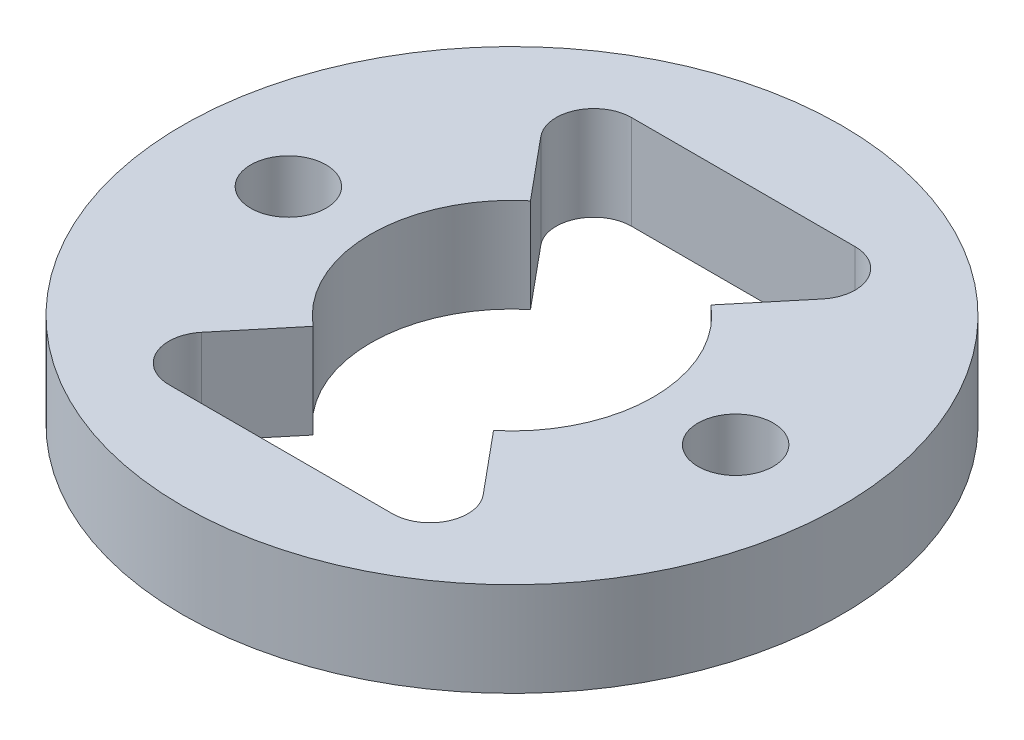
ISO-10303-21;
HEADER;
FILE_DESCRIPTION(('STEP AP214'),'2;1');
FILE_NAME('part.step','',(''),(''),'','','');
FILE_SCHEMA(('AUTOMOTIVE_DESIGN { 1 0 10303 214 1 1 1 1 }'));
ENDSEC;
DATA;
#1=APPLICATION_CONTEXT('core data for automotive mechanical design processes');
#2=APPLICATION_PROTOCOL_DEFINITION('international standard','automotive_design',2000,#1);
#3=PRODUCT_CONTEXT('',#1,'mechanical');
#4=PRODUCT('Part','Part','',(#3));
#5=PRODUCT_RELATED_PRODUCT_CATEGORY('part','',(#4));
#6=PRODUCT_DEFINITION_FORMATION('','',#4);
#7=PRODUCT_DEFINITION_CONTEXT('part definition',#1,'design');
#8=PRODUCT_DEFINITION('design','',#6,#7);
#9=PRODUCT_DEFINITION_SHAPE('','',#8);
#10=(LENGTH_UNIT() NAMED_UNIT(*) SI_UNIT(.MILLI.,.METRE.));
#11=(NAMED_UNIT(*) PLANE_ANGLE_UNIT() SI_UNIT($,.RADIAN.));
#12=(NAMED_UNIT(*) SI_UNIT($,.STERADIAN.) SOLID_ANGLE_UNIT());
#13=UNCERTAINTY_MEASURE_WITH_UNIT(LENGTH_MEASURE(1.E-05),#10,'distance_accuracy_value','');
#14=(GEOMETRIC_REPRESENTATION_CONTEXT(3) GLOBAL_UNCERTAINTY_ASSIGNED_CONTEXT((#13)) GLOBAL_UNIT_ASSIGNED_CONTEXT((#10,
#11,#12)) REPRESENTATION_CONTEXT('',''));
#15=CARTESIAN_POINT('',(0.,0.,0.));
#16=DIRECTION('',(0.,0.,1.));
#17=DIRECTION('',(1.,0.,0.));
#18=AXIS2_PLACEMENT_3D('',#15,#16,#17);
#19=CARTESIAN_POINT('',(7.11474901286555,3.16874166619993,17.6253393049047));
#20=DIRECTION('',(0.,1.,0.));
#21=DIRECTION('',(0.,0.,1.));
#22=AXIS2_PLACEMENT_3D('',#19,#20,#21);
#23=CYLINDRICAL_SURFACE('',#22,6.);
#24=DIRECTION('',(0.,1.,0.));
#25=VECTOR('',#24,1.);
#26=CARTESIAN_POINT('',(3.28246211423467,3.16874166619993,22.242002290935));
#27=LINE('',#26,#25);
#28=CARTESIAN_POINT('',(3.28246211423467,7.16874166619993,22.242002290935));
#29=VERTEX_POINT('',#28);
#30=CARTESIAN_POINT('',(3.28246211423467,3.16874166619993,22.242002290935));
#31=VERTEX_POINT('',#30);
#32=EDGE_CURVE('E134',#29,#31,#27,.F.);
#33=ORIENTED_EDGE('',*,*,#32,.T.);
#34=CARTESIAN_POINT('',(7.11474901286555,3.16874166619993,17.6253393049047));
#35=DIRECTION('',(0.,-1.,0.));
#36=DIRECTION('',(0.,0.,-1.));
#37=AXIS2_PLACEMENT_3D('',#34,#35,#36);
#38=CIRCLE('',#37,6.);
#39=CARTESIAN_POINT('',(3.28246211423467,3.16874166619993,13.0086763188744));
#40=VERTEX_POINT('',#39);
#41=EDGE_CURVE('E153',#31,#40,#38,.T.);
#42=ORIENTED_EDGE('',*,*,#41,.T.);
#43=DIRECTION('',(0.,1.,0.));
#44=VECTOR('',#43,1.);
#45=CARTESIAN_POINT('',(3.28246211423468,3.16874166619993,13.0086763188744));
#46=LINE('',#45,#44);
#47=CARTESIAN_POINT('',(3.28246211423468,7.16874166619993,13.0086763188744));
#48=VERTEX_POINT('',#47);
#49=EDGE_CURVE('E214',#40,#48,#46,.T.);
#50=ORIENTED_EDGE('',*,*,#49,.T.);
#51=CARTESIAN_POINT('',(7.11474901286555,7.16874166619993,17.6253393049047));
#52=DIRECTION('',(0.,-1.,0.));
#53=DIRECTION('',(0.,0.,-1.));
#54=AXIS2_PLACEMENT_3D('',#51,#52,#53);
#55=CIRCLE('',#54,6.);
#56=EDGE_CURVE('E161',#29,#48,#55,.T.);
#57=ORIENTED_EDGE('',*,*,#56,.F.);
#58=EDGE_LOOP('',(#33,#42,#50,#57));
#59=FACE_BOUND('',#58,.T.);
#60=ADVANCED_FACE('F35',(#59),#23,.F.);
#61=CARTESIAN_POINT('',(2.36474901286555,3.16874166619993,25.8525806408569));
#62=DIRECTION('',(0.,1.,0.));
#63=DIRECTION('',(0.,0.,1.));
#64=AXIS2_PLACEMENT_3D('',#61,#62,#63);
#65=CYLINDRICAL_SURFACE('',#64,1.6);
#66=CARTESIAN_POINT('',(2.36474901286555,3.16874166619993,25.8525806408569));
#67=DIRECTION('',(0.,-1.,0.));
#68=DIRECTION('',(0.,0.,-1.));
#69=AXIS2_PLACEMENT_3D('',#66,#67,#68);
#70=CIRCLE('',#69,1.6);
#71=CARTESIAN_POINT('',(2.36474901286555,3.16874166619993,27.4525806408569));
#72=VERTEX_POINT('',#71);
#73=CARTESIAN_POINT('',(1.13363888325747,3.16874166619993,24.8306374678887));
#74=VERTEX_POINT('',#73);
#75=EDGE_CURVE('E164',#72,#74,#70,.T.);
#76=ORIENTED_EDGE('',*,*,#75,.T.);
#77=DIRECTION('',(0.,1.,0.));
#78=VECTOR('',#77,1.);
#79=CARTESIAN_POINT('',(1.13363888325747,3.16874166619993,24.8306374678887));
#80=LINE('',#79,#78);
#81=CARTESIAN_POINT('',(1.13363888325747,7.16874166619993,24.8306374678887));
#82=VERTEX_POINT('',#81);
#83=EDGE_CURVE('E135',#74,#82,#80,.T.);
#84=ORIENTED_EDGE('',*,*,#83,.T.);
#85=CARTESIAN_POINT('',(2.36474901286555,7.16874166619993,25.8525806408569));
#86=DIRECTION('',(0.,-1.,0.));
#87=DIRECTION('',(0.,0.,-1.));
#88=AXIS2_PLACEMENT_3D('',#85,#86,#87);
#89=CIRCLE('',#88,1.6);
#90=CARTESIAN_POINT('',(2.36474901286555,7.16874166619993,27.4525806408569));
#91=VERTEX_POINT('',#90);
#92=EDGE_CURVE('E159',#91,#82,#89,.T.);
#93=ORIENTED_EDGE('',*,*,#92,.F.);
#94=DIRECTION('',(0.,1.,0.));
#95=VECTOR('',#94,1.);
#96=CARTESIAN_POINT('',(2.36474901286555,3.16874166619993,27.4525806408569));
#97=LINE('',#96,#95);
#98=EDGE_CURVE('E238',#91,#72,#97,.F.);
#99=ORIENTED_EDGE('',*,*,#98,.T.);
#100=EDGE_LOOP('',(#76,#84,#93,#99));
#101=FACE_BOUND('',#100,.T.);
#102=ADVANCED_FACE('F249',(#101),#65,.F.);
#103=CARTESIAN_POINT('',(11.8647490128656,3.16874166619993,25.8525806408569));
#104=DIRECTION('',(0.,1.,0.));
#105=DIRECTION('',(0.,0.,1.));
#106=AXIS2_PLACEMENT_3D('',#103,#104,#105);
#107=CYLINDRICAL_SURFACE('',#106,1.6);
#108=CARTESIAN_POINT('',(11.8647490128656,3.16874166619993,25.8525806408569));
#109=DIRECTION('',(0.,-1.,0.));
#110=DIRECTION('',(0.,0.,-1.));
#111=AXIS2_PLACEMENT_3D('',#108,#109,#110);
#112=CIRCLE('',#111,1.6);
#113=CARTESIAN_POINT('',(13.0958591424736,3.16874166619993,24.8306374678886));
#114=VERTEX_POINT('',#113);
#115=CARTESIAN_POINT('',(11.8647490128656,3.16874166619993,27.4525806408569));
#116=VERTEX_POINT('',#115);
#117=EDGE_CURVE('E147',#114,#116,#112,.T.);
#118=ORIENTED_EDGE('',*,*,#117,.T.);
#119=DIRECTION('',(0.,1.,0.));
#120=VECTOR('',#119,1.);
#121=CARTESIAN_POINT('',(11.8647490128656,3.16874166619993,27.4525806408569));
#122=LINE('',#121,#120);
#123=CARTESIAN_POINT('',(11.8647490128656,7.16874166619993,27.4525806408569));
#124=VERTEX_POINT('',#123);
#125=EDGE_CURVE('E240',#116,#124,#122,.T.);
#126=ORIENTED_EDGE('',*,*,#125,.T.);
#127=CARTESIAN_POINT('',(11.8647490128656,7.16874166619993,25.8525806408569));
#128=DIRECTION('',(0.,-1.,0.));
#129=DIRECTION('',(0.,0.,-1.));
#130=AXIS2_PLACEMENT_3D('',#127,#128,#129);
#131=CIRCLE('',#130,1.6);
#132=CARTESIAN_POINT('',(13.0958591424736,7.16874166619993,24.8306374678886));
#133=VERTEX_POINT('',#132);
#134=EDGE_CURVE('E198',#133,#124,#131,.T.);
#135=ORIENTED_EDGE('',*,*,#134,.F.);
#136=DIRECTION('',(0.,1.,0.));
#137=VECTOR('',#136,1.);
#138=CARTESIAN_POINT('',(13.0958591424736,3.16874166619993,24.8306374678886));
#139=LINE('',#138,#137);
#140=EDGE_CURVE('E242',#133,#114,#139,.F.);
#141=ORIENTED_EDGE('',*,*,#140,.T.);
#142=EDGE_LOOP('',(#118,#126,#135,#141));
#143=FACE_BOUND('',#142,.T.);
#144=ADVANCED_FACE('F245',(#143),#107,.F.);
#145=CARTESIAN_POINT('',(2.36474901286555,3.16874166619993,9.39809796895256));
#146=DIRECTION('',(0.,1.,0.));
#147=DIRECTION('',(0.,0.,1.));
#148=AXIS2_PLACEMENT_3D('',#145,#146,#147);
#149=CYLINDRICAL_SURFACE('',#148,1.6);
#150=CARTESIAN_POINT('',(2.36474901286555,3.16874166619993,9.39809796895256));
#151=DIRECTION('',(0.,-1.,0.));
#152=DIRECTION('',(0.,0.,-1.));
#153=AXIS2_PLACEMENT_3D('',#150,#151,#152);
#154=CIRCLE('',#153,1.6);
#155=CARTESIAN_POINT('',(1.13363888325747,3.16874166619993,10.4200411419208));
#156=VERTEX_POINT('',#155);
#157=CARTESIAN_POINT('',(2.36474901286555,3.16874166619993,7.79809796895256));
#158=VERTEX_POINT('',#157);
#159=EDGE_CURVE('E178',#156,#158,#154,.T.);
#160=ORIENTED_EDGE('',*,*,#159,.T.);
#161=DIRECTION('',(0.,1.,0.));
#162=VECTOR('',#161,1.);
#163=CARTESIAN_POINT('',(2.36474901286554,3.16874166619993,7.79809796895256));
#164=LINE('',#163,#162);
#165=CARTESIAN_POINT('',(2.36474901286555,7.16874166619993,7.79809796895256));
#166=VERTEX_POINT('',#165);
#167=EDGE_CURVE('E218',#158,#166,#164,.T.);
#168=ORIENTED_EDGE('',*,*,#167,.T.);
#169=CARTESIAN_POINT('',(2.36474901286555,7.16874166619993,9.39809796895256));
#170=DIRECTION('',(0.,-1.,0.));
#171=DIRECTION('',(0.,0.,-1.));
#172=AXIS2_PLACEMENT_3D('',#169,#170,#171);
#173=CIRCLE('',#172,1.6);
#174=CARTESIAN_POINT('',(1.13363888325747,7.16874166619993,10.4200411419208));
#175=VERTEX_POINT('',#174);
#176=EDGE_CURVE('E181',#175,#166,#173,.T.);
#177=ORIENTED_EDGE('',*,*,#176,.F.);
#178=DIRECTION('',(0.,1.,0.));
#179=VECTOR('',#178,1.);
#180=CARTESIAN_POINT('',(1.13363888325747,3.16874166619993,10.4200411419208));
#181=LINE('',#180,#179);
#182=EDGE_CURVE('E221',#175,#156,#181,.F.);
#183=ORIENTED_EDGE('',*,*,#182,.T.);
#184=EDGE_LOOP('',(#160,#168,#177,#183));
#185=FACE_BOUND('',#184,.T.);
#186=ADVANCED_FACE('F261',(#185),#149,.F.);
#187=CARTESIAN_POINT('',(7.11474901286555,3.16874166619993,17.6253393049047));
#188=DIRECTION('',(0.,-1.,0.));
#189=DIRECTION('',(0.,0.,-1.));
#190=AXIS2_PLACEMENT_3D('',#187,#188,#189);
#191=PLANE('',#190);
#192=DIRECTION('',(0.638714483105146,0.,-0.769443831005048));
#193=VECTOR('',#192,1.);
#194=CARTESIAN_POINT('',(3.28246211423467,3.16874166619993,22.242002290935));
#195=LINE('',#194,#193);
#196=EDGE_CURVE('E230',#74,#31,#195,.T.);
#197=ORIENTED_EDGE('',*,*,#196,.F.);
#198=ORIENTED_EDGE('',*,*,#75,.F.);
#199=DIRECTION('',(-1.,0.,0.));
#200=VECTOR('',#199,1.);
#201=CARTESIAN_POINT('',(2.36474901286555,3.16874166619993,27.4525806408569));
#202=LINE('',#201,#200);
#203=EDGE_CURVE('E148',#116,#72,#202,.T.);
#204=ORIENTED_EDGE('',*,*,#203,.F.);
#205=ORIENTED_EDGE('',*,*,#117,.F.);
#206=DIRECTION('',(0.638714483105147,0.,0.769443831005048));
#207=VECTOR('',#206,1.);
#208=CARTESIAN_POINT('',(13.0958591424736,3.16874166619993,24.8306374678886));
#209=LINE('',#208,#207);
#210=CARTESIAN_POINT('',(10.9470359114964,3.16874166619993,22.242002290935));
#211=VERTEX_POINT('',#210);
#212=EDGE_CURVE('E126',#211,#114,#209,.T.);
#213=ORIENTED_EDGE('',*,*,#212,.F.);
#214=CARTESIAN_POINT('',(10.9470359114964,3.16874166619993,13.0086763188744));
#215=VERTEX_POINT('',#214);
#216=EDGE_CURVE('E144',#215,#211,#38,.T.);
#217=ORIENTED_EDGE('',*,*,#216,.F.);
#218=DIRECTION('',(-0.638714483105146,0.,0.769443831005049));
#219=VECTOR('',#218,1.);
#220=CARTESIAN_POINT('',(13.0958591424736,3.16874166619993,10.4200411419208));
#221=LINE('',#220,#219);
#222=CARTESIAN_POINT('',(13.0958591424736,3.16874166619993,10.4200411419208));
#223=VERTEX_POINT('',#222);
#224=EDGE_CURVE('E208',#223,#215,#221,.T.);
#225=ORIENTED_EDGE('',*,*,#224,.F.);
#226=CARTESIAN_POINT('',(11.8647490128655,3.16874166619993,9.39809796895255));
#227=DIRECTION('',(0.,-1.,0.));
#228=DIRECTION('',(0.,0.,-1.));
#229=AXIS2_PLACEMENT_3D('',#226,#227,#228);
#230=CIRCLE('',#229,1.6);
#231=CARTESIAN_POINT('',(11.8647490128655,3.16874166619993,7.79809796895255));
#232=VERTEX_POINT('',#231);
#233=EDGE_CURVE('E184',#232,#223,#230,.T.);
#234=ORIENTED_EDGE('',*,*,#233,.F.);
#235=DIRECTION('',(1.,0.,0.));
#236=VECTOR('',#235,1.);
#237=CARTESIAN_POINT('',(11.8647490128655,3.16874166619993,7.79809796895255));
#238=LINE('',#237,#236);
#239=EDGE_CURVE('E204',#158,#232,#238,.T.);
#240=ORIENTED_EDGE('',*,*,#239,.F.);
#241=ORIENTED_EDGE('',*,*,#159,.F.);
#242=DIRECTION('',(-0.638714483105147,0.,-0.769443831005048));
#243=VECTOR('',#242,1.);
#244=CARTESIAN_POINT('',(3.28246211423466,3.16874166619993,13.0086763188744));
#245=LINE('',#244,#243);
#246=EDGE_CURVE('E206',#40,#156,#245,.T.);
#247=ORIENTED_EDGE('',*,*,#246,.F.);
#248=ORIENTED_EDGE('',*,*,#41,.F.);
#249=EDGE_LOOP('',(#197,#198,#204,#205,#213,#217,#225,#234,#240,#241,#247,#248));
#250=FACE_BOUND('',#249,.T.);
#251=CARTESIAN_POINT('',(16.6147490128656,3.16874166619993,17.6253393049047));
#252=DIRECTION('',(0.,-1.,0.));
#253=DIRECTION('',(0.,0.,-1.));
#254=AXIS2_PLACEMENT_3D('',#251,#252,#253);
#255=CIRCLE('',#254,1.6);
#256=CARTESIAN_POINT('',(16.6147490128656,3.16874166619993,16.0253393049047));
#257=VERTEX_POINT('',#256);
#258=EDGE_CURVE('E190',#257,#257,#255,.T.);
#259=ORIENTED_EDGE('',*,*,#258,.F.);
#260=EDGE_LOOP('',(#259));
#261=FACE_BOUND('',#260,.T.);
#262=CARTESIAN_POINT('',(7.11474901286555,3.16874166619993,17.6253393049047));
#263=DIRECTION('',(0.,-1.,0.));
#264=DIRECTION('',(0.,0.,-1.));
#265=AXIS2_PLACEMENT_3D('',#262,#263,#264);
#266=CIRCLE('',#265,14.);
#267=CARTESIAN_POINT('',(7.11474901286555,3.16874166619993,3.62533930490472));
#268=VERTEX_POINT('',#267);
#269=EDGE_CURVE('E11',#268,#268,#266,.T.);
#270=ORIENTED_EDGE('',*,*,#269,.T.);
#271=EDGE_LOOP('',(#270));
#272=FACE_BOUND('',#271,.T.);
#273=CARTESIAN_POINT('',(-2.38525098713445,3.16874166619993,17.6253393049047));
#274=DIRECTION('',(0.,-1.,0.));
#275=DIRECTION('',(0.,0.,-1.));
#276=AXIS2_PLACEMENT_3D('',#273,#274,#275);
#277=CIRCLE('',#276,1.6);
#278=CARTESIAN_POINT('',(-2.38525098713445,3.16874166619993,16.0253393049047));
#279=VERTEX_POINT('',#278);
#280=EDGE_CURVE('E173',#279,#279,#277,.T.);
#281=ORIENTED_EDGE('',*,*,#280,.F.);
#282=EDGE_LOOP('',(#281));
#283=FACE_BOUND('',#282,.T.);
#284=ADVANCED_FACE('F141',(#250,#261,#272,#283),#191,.T.);
#285=CARTESIAN_POINT('',(7.11474901286555,7.16874166619993,17.6253393049047));
#286=DIRECTION('',(0.,-1.,0.));
#287=DIRECTION('',(0.,0.,-1.));
#288=AXIS2_PLACEMENT_3D('',#285,#286,#287);
#289=PLANE('',#288);
#290=CARTESIAN_POINT('',(7.11474901286555,7.16874166619993,17.6253393049047));
#291=DIRECTION('',(0.,-1.,0.));
#292=DIRECTION('',(0.,0.,-1.));
#293=AXIS2_PLACEMENT_3D('',#290,#291,#292);
#294=CIRCLE('',#293,14.);
#295=CARTESIAN_POINT('',(7.11474901286555,7.16874166619993,3.62533930490472));
#296=VERTEX_POINT('',#295);
#297=EDGE_CURVE('E39',#296,#296,#294,.T.);
#298=ORIENTED_EDGE('',*,*,#297,.F.);
#299=EDGE_LOOP('',(#298));
#300=FACE_BOUND('',#299,.T.);
#301=CARTESIAN_POINT('',(-2.38525098713445,7.16874166619993,17.6253393049047));
#302=DIRECTION('',(0.,-1.,0.));
#303=DIRECTION('',(0.,0.,-1.));
#304=AXIS2_PLACEMENT_3D('',#301,#302,#303);
#305=CIRCLE('',#304,1.6);
#306=CARTESIAN_POINT('',(-2.38525098713445,7.16874166619993,16.0253393049047));
#307=VERTEX_POINT('',#306);
#308=EDGE_CURVE('E175',#307,#307,#305,.T.);
#309=ORIENTED_EDGE('',*,*,#308,.T.);
#310=EDGE_LOOP('',(#309));
#311=FACE_BOUND('',#310,.T.);
#312=ORIENTED_EDGE('',*,*,#92,.T.);
#313=DIRECTION('',(-0.638714483105147,0.,0.769443831005049));
#314=VECTOR('',#313,1.);
#315=CARTESIAN_POINT('',(3.28246211423467,7.16874166619993,22.242002290935));
#316=LINE('',#315,#314);
#317=EDGE_CURVE('E50',#29,#82,#316,.T.);
#318=ORIENTED_EDGE('',*,*,#317,.F.);
#319=ORIENTED_EDGE('',*,*,#56,.T.);
#320=DIRECTION('',(0.638714483105147,0.,0.769443831005048));
#321=VECTOR('',#320,1.);
#322=CARTESIAN_POINT('',(3.28246211423466,7.16874166619993,13.0086763188744));
#323=LINE('',#322,#321);
#324=EDGE_CURVE('E212',#175,#48,#323,.T.);
#325=ORIENTED_EDGE('',*,*,#324,.F.);
#326=ORIENTED_EDGE('',*,*,#176,.T.);
#327=DIRECTION('',(-1.,0.,0.));
#328=VECTOR('',#327,1.);
#329=CARTESIAN_POINT('',(11.8647490128655,7.16874166619993,7.79809796895255));
#330=LINE('',#329,#328);
#331=CARTESIAN_POINT('',(11.8647490128655,7.16874166619993,7.79809796895255));
#332=VERTEX_POINT('',#331);
#333=EDGE_CURVE('E210',#332,#166,#330,.T.);
#334=ORIENTED_EDGE('',*,*,#333,.F.);
#335=CARTESIAN_POINT('',(11.8647490128655,7.16874166619993,9.39809796895255));
#336=DIRECTION('',(0.,-1.,0.));
#337=DIRECTION('',(0.,0.,-1.));
#338=AXIS2_PLACEMENT_3D('',#335,#336,#337);
#339=CIRCLE('',#338,1.6);
#340=CARTESIAN_POINT('',(13.0958591424736,7.16874166619993,10.4200411419208));
#341=VERTEX_POINT('',#340);
#342=EDGE_CURVE('E187',#332,#341,#339,.T.);
#343=ORIENTED_EDGE('',*,*,#342,.T.);
#344=DIRECTION('',(0.638714483105146,0.,-0.769443831005049));
#345=VECTOR('',#344,1.);
#346=CARTESIAN_POINT('',(13.0958591424736,7.16874166619993,10.4200411419208));
#347=LINE('',#346,#345);
#348=CARTESIAN_POINT('',(10.9470359114964,7.16874166619993,13.0086763188744));
#349=VERTEX_POINT('',#348);
#350=EDGE_CURVE('E201',#349,#341,#347,.T.);
#351=ORIENTED_EDGE('',*,*,#350,.F.);
#352=CARTESIAN_POINT('',(10.9470359114964,7.16874166619993,22.242002290935));
#353=VERTEX_POINT('',#352);
#354=EDGE_CURVE('E156',#349,#353,#55,.T.);
#355=ORIENTED_EDGE('',*,*,#354,.T.);
#356=DIRECTION('',(-0.638714483105147,0.,-0.769443831005048));
#357=VECTOR('',#356,1.);
#358=CARTESIAN_POINT('',(13.0958591424736,7.16874166619993,24.8306374678886));
#359=LINE('',#358,#357);
#360=EDGE_CURVE('E129',#133,#353,#359,.T.);
#361=ORIENTED_EDGE('',*,*,#360,.F.);
#362=ORIENTED_EDGE('',*,*,#134,.T.);
#363=DIRECTION('',(1.,0.,0.));
#364=VECTOR('',#363,1.);
#365=CARTESIAN_POINT('',(2.36474901286555,7.16874166619993,27.4525806408569));
#366=LINE('',#365,#364);
#367=EDGE_CURVE('E58',#91,#124,#366,.T.);
#368=ORIENTED_EDGE('',*,*,#367,.F.);
#369=EDGE_LOOP('',(#312,#318,#319,#325,#326,#334,#343,#351,#355,#361,#362,#368));
#370=FACE_BOUND('',#369,.T.);
#371=CARTESIAN_POINT('',(16.6147490128656,7.16874166619993,17.6253393049047));
#372=DIRECTION('',(0.,-1.,0.));
#373=DIRECTION('',(0.,0.,-1.));
#374=AXIS2_PLACEMENT_3D('',#371,#372,#373);
#375=CIRCLE('',#374,1.6);
#376=CARTESIAN_POINT('',(16.6147490128656,7.16874166619993,16.0253393049047));
#377=VERTEX_POINT('',#376);
#378=EDGE_CURVE('E193',#377,#377,#375,.T.);
#379=ORIENTED_EDGE('',*,*,#378,.T.);
#380=EDGE_LOOP('',(#379));
#381=FACE_BOUND('',#380,.T.);
#382=ADVANCED_FACE('F246',(#300,#311,#370,#381),#289,.F.);
#383=CARTESIAN_POINT('',(7.11474901286555,3.16874166619993,17.6253393049047));
#384=DIRECTION('',(0.,1.,0.));
#385=DIRECTION('',(0.,0.,1.));
#386=AXIS2_PLACEMENT_3D('',#383,#384,#385);
#387=CYLINDRICAL_SURFACE('',#386,14.);
#388=ORIENTED_EDGE('',*,*,#269,.F.);
#389=EDGE_LOOP('',(#388));
#390=FACE_BOUND('',#389,.T.);
#391=ORIENTED_EDGE('',*,*,#297,.T.);
#392=EDGE_LOOP('',(#391));
#393=FACE_BOUND('',#392,.T.);
#394=ADVANCED_FACE('F37',(#390,#393),#387,.T.);
#395=DIRECTION('',(0.,1.,0.));
#396=VECTOR('',#395,1.);
#397=CARTESIAN_POINT('',(10.9470359114964,3.16874166619993,22.242002290935));
#398=LINE('',#397,#396);
#399=EDGE_CURVE('E123',#211,#353,#398,.T.);
#400=ORIENTED_EDGE('',*,*,#399,.T.);
#401=ORIENTED_EDGE('',*,*,#354,.F.);
#402=DIRECTION('',(0.,1.,0.));
#403=VECTOR('',#402,1.);
#404=CARTESIAN_POINT('',(10.9470359114964,3.16874166619993,13.0086763188744));
#405=LINE('',#404,#403);
#406=EDGE_CURVE('E152',#349,#215,#405,.F.);
#407=ORIENTED_EDGE('',*,*,#406,.T.);
#408=ORIENTED_EDGE('',*,*,#216,.T.);
#409=EDGE_LOOP('',(#400,#401,#407,#408));
#410=FACE_BOUND('',#409,.T.);
#411=ADVANCED_FACE('F151',(#410),#23,.F.);
#412=CARTESIAN_POINT('',(-2.38525098713445,3.16874166619993,17.6253393049047));
#413=DIRECTION('',(0.,1.,0.));
#414=DIRECTION('',(0.,0.,1.));
#415=AXIS2_PLACEMENT_3D('',#412,#413,#414);
#416=CYLINDRICAL_SURFACE('',#415,1.6);
#417=ORIENTED_EDGE('',*,*,#280,.T.);
#418=EDGE_LOOP('',(#417));
#419=FACE_BOUND('',#418,.T.);
#420=ORIENTED_EDGE('',*,*,#308,.F.);
#421=EDGE_LOOP('',(#420));
#422=FACE_BOUND('',#421,.T.);
#423=ADVANCED_FACE('F292',(#419,#422),#416,.F.);
#424=CARTESIAN_POINT('',(11.8647490128655,3.16874166619993,9.39809796895255));
#425=DIRECTION('',(0.,1.,0.));
#426=DIRECTION('',(0.,0.,1.));
#427=AXIS2_PLACEMENT_3D('',#424,#425,#426);
#428=CYLINDRICAL_SURFACE('',#427,1.6);
#429=DIRECTION('',(0.,1.,0.));
#430=VECTOR('',#429,1.);
#431=CARTESIAN_POINT('',(11.8647490128655,3.16874166619993,7.79809796895255));
#432=LINE('',#431,#430);
#433=EDGE_CURVE('E224',#332,#232,#432,.F.);
#434=ORIENTED_EDGE('',*,*,#433,.T.);
#435=ORIENTED_EDGE('',*,*,#233,.T.);
#436=DIRECTION('',(0.,1.,0.));
#437=VECTOR('',#436,1.);
#438=CARTESIAN_POINT('',(13.0958591424736,3.16874166619993,10.4200411419208));
#439=LINE('',#438,#437);
#440=EDGE_CURVE('E227',#341,#223,#439,.F.);
#441=ORIENTED_EDGE('',*,*,#440,.F.);
#442=ORIENTED_EDGE('',*,*,#342,.F.);
#443=EDGE_LOOP('',(#434,#435,#441,#442));
#444=FACE_BOUND('',#443,.T.);
#445=ADVANCED_FACE('F268',(#444),#428,.F.);
#446=CARTESIAN_POINT('',(16.6147490128656,3.16874166619993,17.6253393049047));
#447=DIRECTION('',(0.,1.,0.));
#448=DIRECTION('',(0.,0.,1.));
#449=AXIS2_PLACEMENT_3D('',#446,#447,#448);
#450=CYLINDRICAL_SURFACE('',#449,1.6);
#451=ORIENTED_EDGE('',*,*,#258,.T.);
#452=EDGE_LOOP('',(#451));
#453=FACE_BOUND('',#452,.T.);
#454=ORIENTED_EDGE('',*,*,#378,.F.);
#455=EDGE_LOOP('',(#454));
#456=FACE_BOUND('',#455,.T.);
#457=ADVANCED_FACE('F273',(#453,#456),#450,.F.);
#458=CARTESIAN_POINT('',(13.0958591424736,7.16974166619993,10.4200411419208));
#459=DIRECTION('',(0.769443831005049,0.,0.638714483105146));
#460=DIRECTION('',(0.638714483105146,0.,-0.769443831005049));
#461=AXIS2_PLACEMENT_3D('',#458,#459,#460);
#462=PLANE('',#461);
#463=ORIENTED_EDGE('',*,*,#350,.T.);
#464=ORIENTED_EDGE('',*,*,#440,.T.);
#465=ORIENTED_EDGE('',*,*,#224,.T.);
#466=ORIENTED_EDGE('',*,*,#406,.F.);
#467=EDGE_LOOP('',(#463,#464,#465,#466));
#468=FACE_BOUND('',#467,.T.);
#469=ADVANCED_FACE('F271',(#468),#462,.F.);
#470=CARTESIAN_POINT('',(11.8647490128655,7.16974166619993,7.79809796895255));
#471=DIRECTION('',(0.,0.,-1.));
#472=DIRECTION('',(-1.,0.,0.));
#473=AXIS2_PLACEMENT_3D('',#470,#471,#472);
#474=PLANE('',#473);
#475=ORIENTED_EDGE('',*,*,#333,.T.);
#476=ORIENTED_EDGE('',*,*,#167,.F.);
#477=ORIENTED_EDGE('',*,*,#239,.T.);
#478=ORIENTED_EDGE('',*,*,#433,.F.);
#479=EDGE_LOOP('',(#475,#476,#477,#478));
#480=FACE_BOUND('',#479,.T.);
#481=ADVANCED_FACE('F264',(#480),#474,.F.);
#482=CARTESIAN_POINT('',(3.28246211423466,7.16974166619993,13.0086763188744));
#483=DIRECTION('',(-0.769443831005048,0.,0.638714483105147));
#484=DIRECTION('',(0.638714483105147,0.,0.769443831005048));
#485=AXIS2_PLACEMENT_3D('',#482,#483,#484);
#486=PLANE('',#485);
#487=ORIENTED_EDGE('',*,*,#324,.T.);
#488=ORIENTED_EDGE('',*,*,#49,.F.);
#489=ORIENTED_EDGE('',*,*,#246,.T.);
#490=ORIENTED_EDGE('',*,*,#182,.F.);
#491=EDGE_LOOP('',(#487,#488,#489,#490));
#492=FACE_BOUND('',#491,.T.);
#493=ADVANCED_FACE('F257',(#492),#486,.F.);
#494=CARTESIAN_POINT('',(13.0958591424736,7.16974166619993,24.8306374678886));
#495=DIRECTION('',(0.769443831005048,0.,-0.638714483105147));
#496=DIRECTION('',(-0.638714483105147,0.,-0.769443831005048));
#497=AXIS2_PLACEMENT_3D('',#494,#495,#496);
#498=PLANE('',#497);
#499=ORIENTED_EDGE('',*,*,#360,.T.);
#500=ORIENTED_EDGE('',*,*,#399,.F.);
#501=ORIENTED_EDGE('',*,*,#212,.T.);
#502=ORIENTED_EDGE('',*,*,#140,.F.);
#503=EDGE_LOOP('',(#499,#500,#501,#502));
#504=FACE_BOUND('',#503,.T.);
#505=ADVANCED_FACE('F125',(#504),#498,.F.);
#506=CARTESIAN_POINT('',(2.36474901286555,7.16974166619993,27.4525806408569));
#507=DIRECTION('',(0.,0.,1.));
#508=DIRECTION('',(1.,0.,0.));
#509=AXIS2_PLACEMENT_3D('',#506,#507,#508);
#510=PLANE('',#509);
#511=ORIENTED_EDGE('',*,*,#367,.T.);
#512=ORIENTED_EDGE('',*,*,#125,.F.);
#513=ORIENTED_EDGE('',*,*,#203,.T.);
#514=ORIENTED_EDGE('',*,*,#98,.F.);
#515=EDGE_LOOP('',(#511,#512,#513,#514));
#516=FACE_BOUND('',#515,.T.);
#517=ADVANCED_FACE('F400',(#516),#510,.F.);
#518=CARTESIAN_POINT('',(3.28246211423467,7.16974166619993,22.242002290935));
#519=DIRECTION('',(-0.769443831005048,0.,-0.638714483105146));
#520=DIRECTION('',(-0.638714483105147,0.,0.769443831005049));
#521=AXIS2_PLACEMENT_3D('',#518,#519,#520);
#522=PLANE('',#521);
#523=ORIENTED_EDGE('',*,*,#317,.T.);
#524=ORIENTED_EDGE('',*,*,#83,.F.);
#525=ORIENTED_EDGE('',*,*,#196,.T.);
#526=ORIENTED_EDGE('',*,*,#32,.F.);
#527=EDGE_LOOP('',(#523,#524,#525,#526));
#528=FACE_BOUND('',#527,.T.);
#529=ADVANCED_FACE('F250',(#528),#522,.F.);
#530=CLOSED_SHELL('',(#60,#102,#144,#186,#284,#382,#394,#411,#423,#445,#457,#469,#481,#493,#505,
#517,#529));
#531=MANIFOLD_SOLID_BREP('B2',#530);
#532=ADVANCED_BREP_SHAPE_REPRESENTATION('',(#18,#531),#14);
#533=SHAPE_DEFINITION_REPRESENTATION(#9,#532);
ENDSEC;
END-ISO-10303-21;
